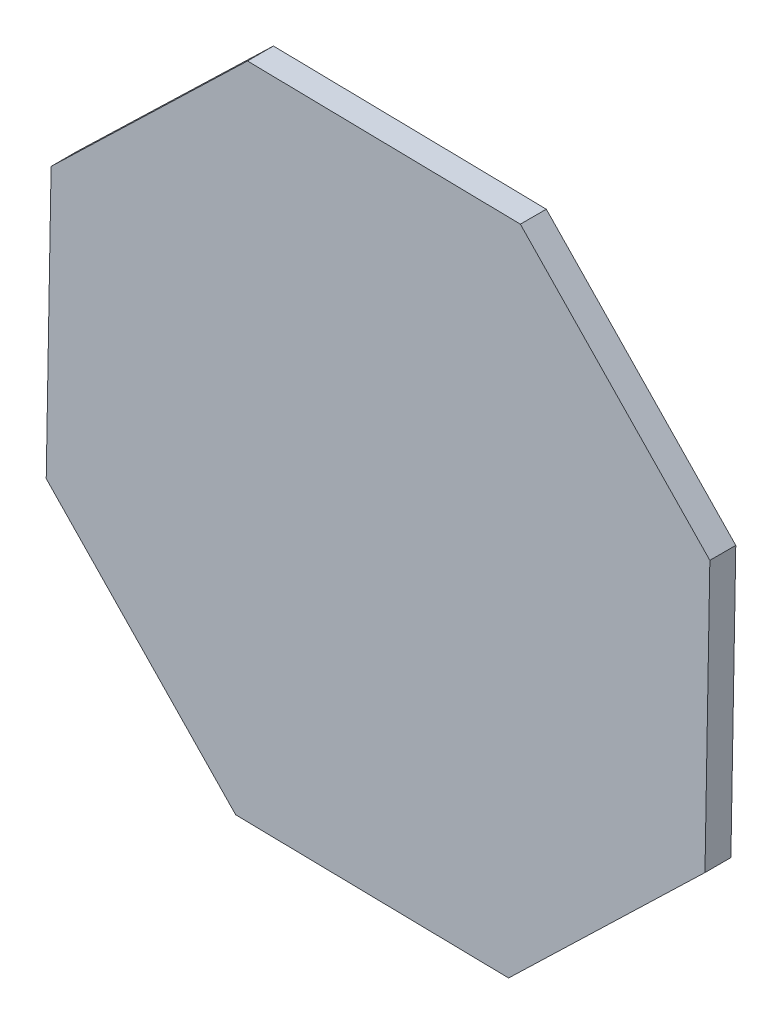
ISO-10303-21;
HEADER;
FILE_DESCRIPTION(('STEP AP214'),'2;1');
FILE_NAME('part.step','',(''),(''),'','','');
FILE_SCHEMA(('AUTOMOTIVE_DESIGN { 1 0 10303 214 1 1 1 1 }'));
ENDSEC;
DATA;
#1=APPLICATION_CONTEXT('core data for automotive mechanical design processes');
#2=APPLICATION_PROTOCOL_DEFINITION('international standard','automotive_design',2000,#1);
#3=PRODUCT_CONTEXT('',#1,'mechanical');
#4=PRODUCT('Part','Part','',(#3));
#5=PRODUCT_RELATED_PRODUCT_CATEGORY('part','',(#4));
#6=PRODUCT_DEFINITION_FORMATION('','',#4);
#7=PRODUCT_DEFINITION_CONTEXT('part definition',#1,'design');
#8=PRODUCT_DEFINITION('design','',#6,#7);
#9=PRODUCT_DEFINITION_SHAPE('','',#8);
#10=(LENGTH_UNIT() NAMED_UNIT(*) SI_UNIT(.MILLI.,.METRE.));
#11=(NAMED_UNIT(*) PLANE_ANGLE_UNIT() SI_UNIT($,.RADIAN.));
#12=(NAMED_UNIT(*) SI_UNIT($,.STERADIAN.) SOLID_ANGLE_UNIT());
#13=UNCERTAINTY_MEASURE_WITH_UNIT(LENGTH_MEASURE(1.E-05),#10,'distance_accuracy_value','');
#14=(GEOMETRIC_REPRESENTATION_CONTEXT(3) GLOBAL_UNCERTAINTY_ASSIGNED_CONTEXT((#13)) GLOBAL_UNIT_ASSIGNED_CONTEXT((#10,
#11,#12)) REPRESENTATION_CONTEXT('',''));
#15=CARTESIAN_POINT('',(0.,0.,0.));
#16=DIRECTION('',(0.,0.,1.));
#17=DIRECTION('',(1.,0.,0.));
#18=AXIS2_PLACEMENT_3D('',#15,#16,#17);
#19=CARTESIAN_POINT('',(-128.087806890355,55.7638209417113,5.08));
#20=DIRECTION('',(0.999839610236386,-0.0179096008429014,0.));
#21=DIRECTION('',(0.0179096008429014,0.999839610236386,0.));
#22=AXIS2_PLACEMENT_3D('',#19,#20,#21);
#23=PLANE('',#22);
#24=DIRECTION('',(-0.0179096008429014,-0.999839610236386,0.));
#25=VECTOR('',#24,1.);
#26=CARTESIAN_POINT('',(-128.087806890355,55.7638209417113,-5.08));
#27=LINE('',#26,#25);
#28=CARTESIAN_POINT('',(-128.087806890355,55.7638209417113,-5.08));
#29=VERTEX_POINT('',#28);
#30=CARTESIAN_POINT('',(-130.00273277224,-51.1407809067268,-5.08));
#31=VERTEX_POINT('',#30);
#32=EDGE_CURVE('E128',#29,#31,#27,.T.);
#33=ORIENTED_EDGE('',*,*,#32,.T.);
#34=DIRECTION('',(0.,0.,-1.));
#35=VECTOR('',#34,1.);
#36=CARTESIAN_POINT('',(-130.00273277224,-51.1407809067268,5.08));
#37=LINE('',#36,#35);
#38=CARTESIAN_POINT('',(-130.00273277224,-51.1407809067268,5.08));
#39=VERTEX_POINT('',#38);
#40=EDGE_CURVE('E11',#39,#31,#37,.T.);
#41=ORIENTED_EDGE('',*,*,#40,.F.);
#42=DIRECTION('',(-0.0179096008429014,-0.999839610236386,0.));
#43=VECTOR('',#42,1.);
#44=CARTESIAN_POINT('',(-128.087806890355,55.7638209417113,5.08));
#45=LINE('',#44,#43);
#46=CARTESIAN_POINT('',(-128.087806890355,55.7638209417113,5.08));
#47=VERTEX_POINT('',#46);
#48=EDGE_CURVE('E142',#47,#39,#45,.T.);
#49=ORIENTED_EDGE('',*,*,#48,.F.);
#50=DIRECTION('',(0.,0.,-1.));
#51=VECTOR('',#50,1.);
#52=CARTESIAN_POINT('',(-128.087806890355,55.7638209417113,5.08));
#53=LINE('',#52,#51);
#54=EDGE_CURVE('E124',#47,#29,#53,.T.);
#55=ORIENTED_EDGE('',*,*,#54,.T.);
#56=EDGE_LOOP('',(#33,#41,#49,#55));
#57=FACE_BOUND('',#56,.T.);
#58=ADVANCED_FACE('F32',(#57),#23,.F.);
#59=CARTESIAN_POINT('',(-130.00273277224,-51.1407809067268,5.08));
#60=DIRECTION('',(0.719657368701423,0.694329368292703,0.));
#61=DIRECTION('',(-0.694329368292703,0.719657368701423,0.));
#62=AXIS2_PLACEMENT_3D('',#59,#60,#61);
#63=PLANE('',#62);
#64=DIRECTION('',(0.694329368292703,-0.719657368701423,0.));
#65=VECTOR('',#64,1.);
#66=CARTESIAN_POINT('',(-130.00273277224,-51.1407809067268,-5.08));
#67=LINE('',#66,#65);
#68=CARTESIAN_POINT('',(-55.7638209417113,-128.087806890355,-5.08));
#69=VERTEX_POINT('',#68);
#70=EDGE_CURVE('E131',#31,#69,#67,.T.);
#71=ORIENTED_EDGE('',*,*,#70,.T.);
#72=DIRECTION('',(0.,0.,-1.));
#73=VECTOR('',#72,1.);
#74=CARTESIAN_POINT('',(-55.7638209417113,-128.087806890355,5.08));
#75=LINE('',#74,#73);
#76=CARTESIAN_POINT('',(-55.7638209417113,-128.087806890355,5.08));
#77=VERTEX_POINT('',#76);
#78=EDGE_CURVE('E40',#77,#69,#75,.T.);
#79=ORIENTED_EDGE('',*,*,#78,.F.);
#80=DIRECTION('',(0.694329368292703,-0.719657368701423,0.));
#81=VECTOR('',#80,1.);
#82=CARTESIAN_POINT('',(-130.00273277224,-51.1407809067268,5.08));
#83=LINE('',#82,#81);
#84=EDGE_CURVE('E91',#39,#77,#83,.T.);
#85=ORIENTED_EDGE('',*,*,#84,.F.);
#86=ORIENTED_EDGE('',*,*,#40,.T.);
#87=EDGE_LOOP('',(#71,#79,#85,#86));
#88=FACE_BOUND('',#87,.T.);
#89=ADVANCED_FACE('F177',(#88),#63,.F.);
#90=CARTESIAN_POINT('',(-55.7638209417113,-128.087806890355,5.08));
#91=DIRECTION('',(0.0179096008429013,0.999839610236386,0.));
#92=DIRECTION('',(-0.999839610236386,0.0179096008429014,0.));
#93=AXIS2_PLACEMENT_3D('',#90,#91,#92);
#94=PLANE('',#93);
#95=DIRECTION('',(0.999839610236386,-0.0179096008429013,0.));
#96=VECTOR('',#95,1.);
#97=CARTESIAN_POINT('',(-55.7638209417113,-128.087806890355,-5.08));
#98=LINE('',#97,#96);
#99=CARTESIAN_POINT('',(51.1407809067269,-130.00273277224,-5.08));
#100=VERTEX_POINT('',#99);
#101=EDGE_CURVE('E133',#69,#100,#98,.T.);
#102=ORIENTED_EDGE('',*,*,#101,.T.);
#103=DIRECTION('',(0.,0.,-1.));
#104=VECTOR('',#103,1.);
#105=CARTESIAN_POINT('',(51.1407809067269,-130.00273277224,5.08));
#106=LINE('',#105,#104);
#107=CARTESIAN_POINT('',(51.1407809067269,-130.00273277224,5.08));
#108=VERTEX_POINT('',#107);
#109=EDGE_CURVE('E149',#108,#100,#106,.T.);
#110=ORIENTED_EDGE('',*,*,#109,.F.);
#111=DIRECTION('',(0.999839610236386,-0.0179096008429013,0.));
#112=VECTOR('',#111,1.);
#113=CARTESIAN_POINT('',(-55.7638209417113,-128.087806890355,5.08));
#114=LINE('',#113,#112);
#115=EDGE_CURVE('E157',#77,#108,#114,.T.);
#116=ORIENTED_EDGE('',*,*,#115,.F.);
#117=ORIENTED_EDGE('',*,*,#78,.T.);
#118=EDGE_LOOP('',(#102,#110,#116,#117));
#119=FACE_BOUND('',#118,.T.);
#120=ADVANCED_FACE('F155',(#119),#94,.F.);
#121=CARTESIAN_POINT('',(51.1407809067269,-130.00273277224,5.08));
#122=DIRECTION('',(-0.694329368292703,0.719657368701423,0.));
#123=DIRECTION('',(-0.719657368701423,-0.694329368292704,0.));
#124=AXIS2_PLACEMENT_3D('',#121,#122,#123);
#125=PLANE('',#124);
#126=DIRECTION('',(0.719657368701423,0.694329368292703,0.));
#127=VECTOR('',#126,1.);
#128=CARTESIAN_POINT('',(51.1407809067269,-130.00273277224,-5.08));
#129=LINE('',#128,#127);
#130=CARTESIAN_POINT('',(128.087806890355,-55.7638209417113,-5.08));
#131=VERTEX_POINT('',#130);
#132=EDGE_CURVE('E135',#100,#131,#129,.T.);
#133=ORIENTED_EDGE('',*,*,#132,.T.);
#134=DIRECTION('',(0.,0.,-1.));
#135=VECTOR('',#134,1.);
#136=CARTESIAN_POINT('',(128.087806890355,-55.7638209417113,5.08));
#137=LINE('',#136,#135);
#138=CARTESIAN_POINT('',(128.087806890355,-55.7638209417113,5.08));
#139=VERTEX_POINT('',#138);
#140=EDGE_CURVE('E146',#139,#131,#137,.T.);
#141=ORIENTED_EDGE('',*,*,#140,.F.);
#142=DIRECTION('',(0.719657368701423,0.694329368292703,0.));
#143=VECTOR('',#142,1.);
#144=CARTESIAN_POINT('',(51.1407809067269,-130.00273277224,5.08));
#145=LINE('',#144,#143);
#146=EDGE_CURVE('E169',#108,#139,#145,.T.);
#147=ORIENTED_EDGE('',*,*,#146,.F.);
#148=ORIENTED_EDGE('',*,*,#109,.T.);
#149=EDGE_LOOP('',(#133,#141,#147,#148));
#150=FACE_BOUND('',#149,.T.);
#151=ADVANCED_FACE('F165',(#150),#125,.F.);
#152=CARTESIAN_POINT('',(128.087806890355,-55.7638209417113,5.08));
#153=DIRECTION('',(-0.999839610236386,0.0179096008429014,0.));
#154=DIRECTION('',(-0.0179096008429014,-0.999839610236386,0.));
#155=AXIS2_PLACEMENT_3D('',#152,#153,#154);
#156=PLANE('',#155);
#157=DIRECTION('',(0.0179096008429014,0.999839610236386,0.));
#158=VECTOR('',#157,1.);
#159=CARTESIAN_POINT('',(128.087806890355,-55.7638209417113,-5.08));
#160=LINE('',#159,#158);
#161=CARTESIAN_POINT('',(130.00273277224,51.1407809067268,-5.08));
#162=VERTEX_POINT('',#161);
#163=EDGE_CURVE('E137',#131,#162,#160,.T.);
#164=ORIENTED_EDGE('',*,*,#163,.T.);
#165=DIRECTION('',(0.,0.,-1.));
#166=VECTOR('',#165,1.);
#167=CARTESIAN_POINT('',(130.00273277224,51.1407809067268,5.08));
#168=LINE('',#167,#166);
#169=CARTESIAN_POINT('',(130.00273277224,51.1407809067268,5.08));
#170=VERTEX_POINT('',#169);
#171=EDGE_CURVE('E119',#170,#162,#168,.T.);
#172=ORIENTED_EDGE('',*,*,#171,.F.);
#173=DIRECTION('',(0.0179096008429014,0.999839610236386,0.));
#174=VECTOR('',#173,1.);
#175=CARTESIAN_POINT('',(128.087806890355,-55.7638209417113,5.08));
#176=LINE('',#175,#174);
#177=EDGE_CURVE('E110',#139,#170,#176,.T.);
#178=ORIENTED_EDGE('',*,*,#177,.F.);
#179=ORIENTED_EDGE('',*,*,#140,.T.);
#180=EDGE_LOOP('',(#164,#172,#178,#179));
#181=FACE_BOUND('',#180,.T.);
#182=ADVANCED_FACE('F168',(#181),#156,.F.);
#183=CARTESIAN_POINT('',(130.00273277224,51.1407809067268,5.08));
#184=DIRECTION('',(-0.719657368701423,-0.694329368292703,0.));
#185=DIRECTION('',(0.694329368292703,-0.719657368701423,0.));
#186=AXIS2_PLACEMENT_3D('',#183,#184,#185);
#187=PLANE('',#186);
#188=DIRECTION('',(-0.694329368292703,0.719657368701423,0.));
#189=VECTOR('',#188,1.);
#190=CARTESIAN_POINT('',(130.00273277224,51.1407809067268,-5.08));
#191=LINE('',#190,#189);
#192=CARTESIAN_POINT('',(55.7638209417113,128.087806890355,-5.08));
#193=VERTEX_POINT('',#192);
#194=EDGE_CURVE('E118',#162,#193,#191,.T.);
#195=ORIENTED_EDGE('',*,*,#194,.T.);
#196=DIRECTION('',(0.,0.,-1.));
#197=VECTOR('',#196,1.);
#198=CARTESIAN_POINT('',(55.7638209417113,128.087806890355,5.08));
#199=LINE('',#198,#197);
#200=CARTESIAN_POINT('',(55.7638209417113,128.087806890355,5.08));
#201=VERTEX_POINT('',#200);
#202=EDGE_CURVE('E115',#201,#193,#199,.T.);
#203=ORIENTED_EDGE('',*,*,#202,.F.);
#204=DIRECTION('',(-0.694329368292703,0.719657368701423,0.));
#205=VECTOR('',#204,1.);
#206=CARTESIAN_POINT('',(130.00273277224,51.1407809067268,5.08));
#207=LINE('',#206,#205);
#208=EDGE_CURVE('E104',#170,#201,#207,.T.);
#209=ORIENTED_EDGE('',*,*,#208,.F.);
#210=ORIENTED_EDGE('',*,*,#171,.T.);
#211=EDGE_LOOP('',(#195,#203,#209,#210));
#212=FACE_BOUND('',#211,.T.);
#213=ADVANCED_FACE('F116',(#212),#187,.F.);
#214=CARTESIAN_POINT('',(55.7638209417113,128.087806890355,5.08));
#215=DIRECTION('',(-0.0179096008429014,-0.999839610236386,0.));
#216=DIRECTION('',(0.999839610236386,-0.0179096008429014,0.));
#217=AXIS2_PLACEMENT_3D('',#214,#215,#216);
#218=PLANE('',#217);
#219=DIRECTION('',(-0.999839610236386,0.0179096008429014,0.));
#220=VECTOR('',#219,1.);
#221=CARTESIAN_POINT('',(55.7638209417113,128.087806890355,-5.08));
#222=LINE('',#221,#220);
#223=CARTESIAN_POINT('',(-51.1407809067268,130.00273277224,-5.08));
#224=VERTEX_POINT('',#223);
#225=EDGE_CURVE('E77',#193,#224,#222,.T.);
#226=ORIENTED_EDGE('',*,*,#225,.T.);
#227=DIRECTION('',(0.,0.,-1.));
#228=VECTOR('',#227,1.);
#229=CARTESIAN_POINT('',(-51.1407809067268,130.00273277224,5.08));
#230=LINE('',#229,#228);
#231=CARTESIAN_POINT('',(-51.1407809067268,130.00273277224,5.08));
#232=VERTEX_POINT('',#231);
#233=EDGE_CURVE('E120',#232,#224,#230,.T.);
#234=ORIENTED_EDGE('',*,*,#233,.F.);
#235=DIRECTION('',(-0.999839610236386,0.0179096008429014,0.));
#236=VECTOR('',#235,1.);
#237=CARTESIAN_POINT('',(55.7638209417113,128.087806890355,5.08));
#238=LINE('',#237,#236);
#239=EDGE_CURVE('E108',#201,#232,#238,.T.);
#240=ORIENTED_EDGE('',*,*,#239,.F.);
#241=ORIENTED_EDGE('',*,*,#202,.T.);
#242=EDGE_LOOP('',(#226,#234,#240,#241));
#243=FACE_BOUND('',#242,.T.);
#244=ADVANCED_FACE('F122',(#243),#218,.F.);
#245=CARTESIAN_POINT('',(-51.1407809067268,130.00273277224,5.08));
#246=DIRECTION('',(0.694329368292703,-0.719657368701423,0.));
#247=DIRECTION('',(0.719657368701423,0.694329368292703,0.));
#248=AXIS2_PLACEMENT_3D('',#245,#246,#247);
#249=PLANE('',#248);
#250=DIRECTION('',(-0.719657368701423,-0.694329368292703,0.));
#251=VECTOR('',#250,1.);
#252=CARTESIAN_POINT('',(-51.1407809067268,130.00273277224,-5.08));
#253=LINE('',#252,#251);
#254=EDGE_CURVE('E83',#224,#29,#253,.T.);
#255=ORIENTED_EDGE('',*,*,#254,.T.);
#256=ORIENTED_EDGE('',*,*,#54,.F.);
#257=DIRECTION('',(-0.719657368701423,-0.694329368292703,0.));
#258=VECTOR('',#257,1.);
#259=CARTESIAN_POINT('',(-51.1407809067268,130.00273277224,5.08));
#260=LINE('',#259,#258);
#261=EDGE_CURVE('E48',#232,#47,#260,.T.);
#262=ORIENTED_EDGE('',*,*,#261,.F.);
#263=ORIENTED_EDGE('',*,*,#233,.T.);
#264=EDGE_LOOP('',(#255,#256,#262,#263));
#265=FACE_BOUND('',#264,.T.);
#266=ADVANCED_FACE('F193',(#265),#249,.F.);
#267=CARTESIAN_POINT('',(-131.35678984879,-126.733749813805,5.08));
#268=DIRECTION('',(0.,0.,1.));
#269=DIRECTION('',(1.,0.,0.));
#270=AXIS2_PLACEMENT_3D('',#267,#268,#269);
#271=PLANE('',#270);
#272=ORIENTED_EDGE('',*,*,#48,.T.);
#273=ORIENTED_EDGE('',*,*,#84,.T.);
#274=ORIENTED_EDGE('',*,*,#115,.T.);
#275=ORIENTED_EDGE('',*,*,#146,.T.);
#276=ORIENTED_EDGE('',*,*,#177,.T.);
#277=ORIENTED_EDGE('',*,*,#208,.T.);
#278=ORIENTED_EDGE('',*,*,#239,.T.);
#279=ORIENTED_EDGE('',*,*,#261,.T.);
#280=EDGE_LOOP('',(#272,#273,#274,#275,#276,#277,#278,#279));
#281=FACE_BOUND('',#280,.T.);
#282=ADVANCED_FACE('F106',(#281),#271,.T.);
#283=CARTESIAN_POINT('',(-131.35678984879,-126.733749813805,-5.08));
#284=DIRECTION('',(0.,0.,1.));
#285=DIRECTION('',(1.,0.,0.));
#286=AXIS2_PLACEMENT_3D('',#283,#284,#285);
#287=PLANE('',#286);
#288=ORIENTED_EDGE('',*,*,#32,.F.);
#289=ORIENTED_EDGE('',*,*,#254,.F.);
#290=ORIENTED_EDGE('',*,*,#225,.F.);
#291=ORIENTED_EDGE('',*,*,#194,.F.);
#292=ORIENTED_EDGE('',*,*,#163,.F.);
#293=ORIENTED_EDGE('',*,*,#132,.F.);
#294=ORIENTED_EDGE('',*,*,#101,.F.);
#295=ORIENTED_EDGE('',*,*,#70,.F.);
#296=EDGE_LOOP('',(#288,#289,#290,#291,#292,#293,#294,#295));
#297=FACE_BOUND('',#296,.T.);
#298=ADVANCED_FACE('F161',(#297),#287,.F.);
#299=CLOSED_SHELL('',(#58,#89,#120,#151,#182,#213,#244,#266,#282,#298));
#300=MANIFOLD_SOLID_BREP('B2',#299);
#301=ADVANCED_BREP_SHAPE_REPRESENTATION('',(#18,#300),#14);
#302=SHAPE_DEFINITION_REPRESENTATION(#9,#301);
ENDSEC;
END-ISO-10303-21;
